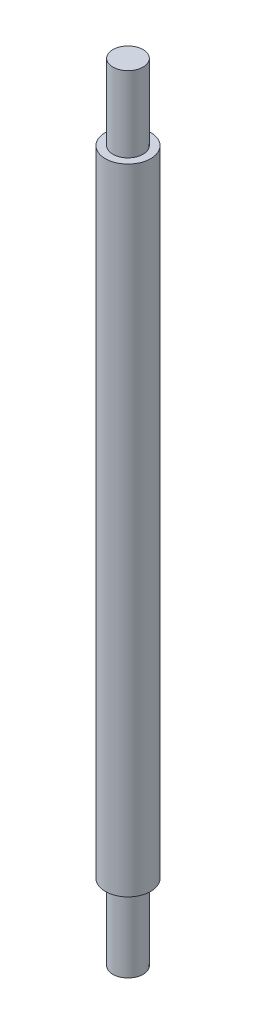
ISO-10303-21;
HEADER;
FILE_DESCRIPTION(('STEP AP214'),'2;1');
FILE_NAME('part.step','',(''),(''),'','','');
FILE_SCHEMA(('AUTOMOTIVE_DESIGN { 1 0 10303 214 1 1 1 1 }'));
ENDSEC;
DATA;
#1=APPLICATION_CONTEXT('core data for automotive mechanical design processes');
#2=APPLICATION_PROTOCOL_DEFINITION('international standard','automotive_design',2000,#1);
#3=PRODUCT_CONTEXT('',#1,'mechanical');
#4=PRODUCT('Part','Part','',(#3));
#5=PRODUCT_RELATED_PRODUCT_CATEGORY('part','',(#4));
#6=PRODUCT_DEFINITION_FORMATION('','',#4);
#7=PRODUCT_DEFINITION_CONTEXT('part definition',#1,'design');
#8=PRODUCT_DEFINITION('design','',#6,#7);
#9=PRODUCT_DEFINITION_SHAPE('','',#8);
#10=(LENGTH_UNIT() NAMED_UNIT(*) SI_UNIT(.MILLI.,.METRE.));
#11=(NAMED_UNIT(*) PLANE_ANGLE_UNIT() SI_UNIT($,.RADIAN.));
#12=(NAMED_UNIT(*) SI_UNIT($,.STERADIAN.) SOLID_ANGLE_UNIT());
#13=UNCERTAINTY_MEASURE_WITH_UNIT(LENGTH_MEASURE(1.E-05),#10,'distance_accuracy_value','');
#14=(GEOMETRIC_REPRESENTATION_CONTEXT(3) GLOBAL_UNCERTAINTY_ASSIGNED_CONTEXT((#13)) GLOBAL_UNIT_ASSIGNED_CONTEXT((#10,
#11,#12)) REPRESENTATION_CONTEXT('',''));
#15=CARTESIAN_POINT('',(0.,0.,0.));
#16=DIRECTION('',(0.,0.,1.));
#17=DIRECTION('',(1.,0.,0.));
#18=AXIS2_PLACEMENT_3D('',#15,#16,#17);
#19=CARTESIAN_POINT('',(0.,0.,0.));
#20=DIRECTION('',(0.,1.,0.));
#21=DIRECTION('',(-1.,0.,0.));
#22=AXIS2_PLACEMENT_3D('',#19,#20,#21);
#23=PLANE('',#22);
#24=CARTESIAN_POINT('',(0.,0.,0.));
#25=DIRECTION('',(0.,1.,0.));
#26=DIRECTION('',(-1.,0.,0.));
#27=AXIS2_PLACEMENT_3D('',#24,#25,#26);
#28=CIRCLE('',#27,2.);
#29=CARTESIAN_POINT('',(-2.,0.,0.));
#30=VERTEX_POINT('',#29);
#31=EDGE_CURVE('E10',#30,#30,#28,.T.);
#32=ORIENTED_EDGE('',*,*,#31,.F.);
#33=EDGE_LOOP('',(#32));
#34=FACE_BOUND('',#33,.T.);
#35=ADVANCED_FACE('F31',(#34),#23,.F.);
#36=CARTESIAN_POINT('',(0.,104.,0.));
#37=DIRECTION('',(0.,1.,0.));
#38=DIRECTION('',(-1.,0.,0.));
#39=AXIS2_PLACEMENT_3D('',#36,#37,#38);
#40=CYLINDRICAL_SURFACE('',#39,2.);
#41=CARTESIAN_POINT('',(0.,9.99999999999999,0.));
#42=DIRECTION('',(0.,1.,0.));
#43=DIRECTION('',(-1.,0.,0.));
#44=AXIS2_PLACEMENT_3D('',#41,#42,#43);
#45=CIRCLE('',#44,2.);
#46=CARTESIAN_POINT('',(-2.,9.99999999999999,0.));
#47=VERTEX_POINT('',#46);
#48=EDGE_CURVE('E37',#47,#47,#45,.T.);
#49=ORIENTED_EDGE('',*,*,#48,.F.);
#50=EDGE_LOOP('',(#49));
#51=FACE_BOUND('',#50,.T.);
#52=ORIENTED_EDGE('',*,*,#31,.T.);
#53=EDGE_LOOP('',(#52));
#54=FACE_BOUND('',#53,.T.);
#55=ADVANCED_FACE('F79',(#51,#54),#40,.T.);
#56=CARTESIAN_POINT('',(2.,10.,0.));
#57=DIRECTION('',(0.,1.,0.));
#58=DIRECTION('',(-1.,0.,0.));
#59=AXIS2_PLACEMENT_3D('',#56,#57,#58);
#60=PLANE('',#59);
#61=CARTESIAN_POINT('',(0.,9.99999999999999,0.));
#62=DIRECTION('',(0.,1.,0.));
#63=DIRECTION('',(-1.,0.,0.));
#64=AXIS2_PLACEMENT_3D('',#61,#62,#63);
#65=CIRCLE('',#64,3.00000000000001);
#66=CARTESIAN_POINT('',(-3.00000000000002,9.99999999999999,0.));
#67=VERTEX_POINT('',#66);
#68=EDGE_CURVE('E41',#67,#67,#65,.T.);
#69=ORIENTED_EDGE('',*,*,#68,.F.);
#70=EDGE_LOOP('',(#69));
#71=FACE_BOUND('',#70,.T.);
#72=ORIENTED_EDGE('',*,*,#48,.T.);
#73=EDGE_LOOP('',(#72));
#74=FACE_BOUND('',#73,.T.);
#75=ADVANCED_FACE('F74',(#71,#74),#60,.F.);
#76=CARTESIAN_POINT('',(0.,104.,0.));
#77=DIRECTION('',(0.,1.,0.));
#78=DIRECTION('',(-1.,0.,0.));
#79=AXIS2_PLACEMENT_3D('',#76,#77,#78);
#80=CYLINDRICAL_SURFACE('',#79,3.00000000000002);
#81=CARTESIAN_POINT('',(0.,94.,0.));
#82=DIRECTION('',(0.,1.,0.));
#83=DIRECTION('',(-1.,0.,0.));
#84=AXIS2_PLACEMENT_3D('',#81,#82,#83);
#85=CIRCLE('',#84,3.00000000000002);
#86=CARTESIAN_POINT('',(-3.00000000000003,94.,0.));
#87=VERTEX_POINT('',#86);
#88=EDGE_CURVE('E45',#87,#87,#85,.T.);
#89=ORIENTED_EDGE('',*,*,#88,.F.);
#90=EDGE_LOOP('',(#89));
#91=FACE_BOUND('',#90,.T.);
#92=ORIENTED_EDGE('',*,*,#68,.T.);
#93=EDGE_LOOP('',(#92));
#94=FACE_BOUND('',#93,.T.);
#95=ADVANCED_FACE('F68',(#91,#94),#80,.T.);
#96=CARTESIAN_POINT('',(3.00000000000001,94.,0.));
#97=DIRECTION('',(0.,-1.,0.));
#98=DIRECTION('',(1.,0.,0.));
#99=AXIS2_PLACEMENT_3D('',#96,#97,#98);
#100=PLANE('',#99);
#101=CARTESIAN_POINT('',(0.,94.,0.));
#102=DIRECTION('',(0.,1.,0.));
#103=DIRECTION('',(-1.,0.,0.));
#104=AXIS2_PLACEMENT_3D('',#101,#102,#103);
#105=CIRCLE('',#104,2.00000000000001);
#106=CARTESIAN_POINT('',(-2.00000000000002,94.,0.));
#107=VERTEX_POINT('',#106);
#108=EDGE_CURVE('E50',#107,#107,#105,.T.);
#109=ORIENTED_EDGE('',*,*,#108,.F.);
#110=EDGE_LOOP('',(#109));
#111=FACE_BOUND('',#110,.T.);
#112=ORIENTED_EDGE('',*,*,#88,.T.);
#113=EDGE_LOOP('',(#112));
#114=FACE_BOUND('',#113,.T.);
#115=ADVANCED_FACE('F62',(#111,#114),#100,.F.);
#116=CARTESIAN_POINT('',(0.,104.,0.));
#117=DIRECTION('',(0.,1.,0.));
#118=DIRECTION('',(-1.,0.,0.));
#119=AXIS2_PLACEMENT_3D('',#116,#117,#118);
#120=CYLINDRICAL_SURFACE('',#119,2.00000000000001);
#121=CARTESIAN_POINT('',(0.,104.,0.));
#122=DIRECTION('',(0.,1.,0.));
#123=DIRECTION('',(-1.,0.,0.));
#124=AXIS2_PLACEMENT_3D('',#121,#122,#123);
#125=CIRCLE('',#124,2.);
#126=CARTESIAN_POINT('',(-2.00000000000001,104.,0.));
#127=VERTEX_POINT('',#126);
#128=EDGE_CURVE('E53',#127,#127,#125,.T.);
#129=ORIENTED_EDGE('',*,*,#128,.F.);
#130=EDGE_LOOP('',(#129));
#131=FACE_BOUND('',#130,.T.);
#132=ORIENTED_EDGE('',*,*,#108,.T.);
#133=EDGE_LOOP('',(#132));
#134=FACE_BOUND('',#133,.T.);
#135=ADVANCED_FACE('F59',(#131,#134),#120,.T.);
#136=CARTESIAN_POINT('',(1.99999999999999,104.,0.));
#137=DIRECTION('',(0.,-1.,0.));
#138=DIRECTION('',(1.,0.,0.));
#139=AXIS2_PLACEMENT_3D('',#136,#137,#138);
#140=PLANE('',#139);
#141=ORIENTED_EDGE('',*,*,#128,.T.);
#142=EDGE_LOOP('',(#141));
#143=FACE_BOUND('',#142,.T.);
#144=ADVANCED_FACE('F57',(#143),#140,.F.);
#145=CLOSED_SHELL('',(#35,#55,#75,#95,#115,#135,#144));
#146=MANIFOLD_SOLID_BREP('B2',#145);
#147=ADVANCED_BREP_SHAPE_REPRESENTATION('',(#18,#146),#14);
#148=SHAPE_DEFINITION_REPRESENTATION(#9,#147);
ENDSEC;
END-ISO-10303-21;
